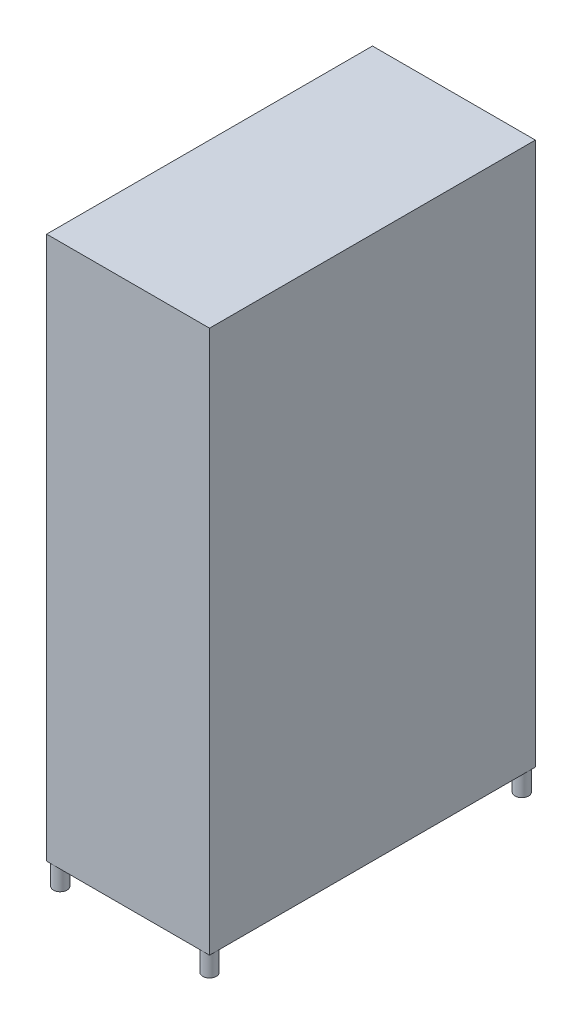
ISO-10303-21;
HEADER;
FILE_DESCRIPTION(('STEP AP214'),'2;1');
FILE_NAME('part.step','',(''),(''),'','','');
FILE_SCHEMA(('AUTOMOTIVE_DESIGN { 1 0 10303 214 1 1 1 1 }'));
ENDSEC;
DATA;
#1=APPLICATION_CONTEXT('core data for automotive mechanical design processes');
#2=APPLICATION_PROTOCOL_DEFINITION('international standard','automotive_design',2000,#1);
#3=PRODUCT_CONTEXT('',#1,'mechanical');
#4=PRODUCT('Part','Part','',(#3));
#5=PRODUCT_RELATED_PRODUCT_CATEGORY('part','',(#4));
#6=PRODUCT_DEFINITION_FORMATION('','',#4);
#7=PRODUCT_DEFINITION_CONTEXT('part definition',#1,'design');
#8=PRODUCT_DEFINITION('design','',#6,#7);
#9=PRODUCT_DEFINITION_SHAPE('','',#8);
#10=(LENGTH_UNIT() NAMED_UNIT(*) SI_UNIT(.MILLI.,.METRE.));
#11=(NAMED_UNIT(*) PLANE_ANGLE_UNIT() SI_UNIT($,.RADIAN.));
#12=(NAMED_UNIT(*) SI_UNIT($,.STERADIAN.) SOLID_ANGLE_UNIT());
#13=UNCERTAINTY_MEASURE_WITH_UNIT(LENGTH_MEASURE(1.E-05),#10,'distance_accuracy_value','');
#14=(GEOMETRIC_REPRESENTATION_CONTEXT(3) GLOBAL_UNCERTAINTY_ASSIGNED_CONTEXT((#13)) GLOBAL_UNIT_ASSIGNED_CONTEXT((#10,
#11,#12)) REPRESENTATION_CONTEXT('',''));
#15=CARTESIAN_POINT('',(0.,0.,0.));
#16=DIRECTION('',(0.,0.,1.));
#17=DIRECTION('',(1.,0.,0.));
#18=AXIS2_PLACEMENT_3D('',#15,#16,#17);
#19=CARTESIAN_POINT('',(0.,0.,0.));
#20=DIRECTION('',(0.,-1.,0.));
#21=DIRECTION('',(0.,0.,-1.));
#22=AXIS2_PLACEMENT_3D('',#19,#20,#21);
#23=PLANE('',#22);
#24=DIRECTION('',(-1.,0.,0.));
#25=VECTOR('',#24,1.);
#26=CARTESIAN_POINT('',(-300.,0.,-600.));
#27=LINE('',#26,#25);
#28=CARTESIAN_POINT('',(-275.,0.,-600.));
#29=VERTEX_POINT('',#28);
#30=CARTESIAN_POINT('',(-300.,0.,-600.));
#31=VERTEX_POINT('',#30);
#32=EDGE_CURVE('E104',#29,#31,#27,.T.);
#33=ORIENTED_EDGE('',*,*,#32,.F.);
#34=CARTESIAN_POINT('',(-275.,0.,-575.));
#35=DIRECTION('',(0.,-1.,0.));
#36=DIRECTION('',(0.,0.,1.));
#37=AXIS2_PLACEMENT_3D('',#34,#35,#36);
#38=CIRCLE('',#37,25.);
#39=CARTESIAN_POINT('',(-300.,0.,-575.));
#40=VERTEX_POINT('',#39);
#41=EDGE_CURVE('E49',#40,#29,#38,.T.);
#42=ORIENTED_EDGE('',*,*,#41,.F.);
#43=DIRECTION('',(0.,0.,1.));
#44=VECTOR('',#43,1.);
#45=CARTESIAN_POINT('',(-300.,0.,600.));
#46=LINE('',#45,#44);
#47=EDGE_CURVE('E103',#31,#40,#46,.T.);
#48=ORIENTED_EDGE('',*,*,#47,.F.);
#49=EDGE_LOOP('',(#33,#42,#48));
#50=FACE_BOUND('',#49,.T.);
#51=ADVANCED_FACE('F35',(#50),#23,.T.);
#52=CARTESIAN_POINT('',(-300.,0.,575.));
#53=VERTEX_POINT('',#52);
#54=EDGE_CURVE('E109',#40,#53,#46,.T.);
#55=ORIENTED_EDGE('',*,*,#54,.F.);
#56=CARTESIAN_POINT('',(-275.,0.,-575.));
#57=DIRECTION('',(0.,-1.,0.));
#58=DIRECTION('',(0.,0.,-1.));
#59=AXIS2_PLACEMENT_3D('',#56,#57,#58);
#60=CIRCLE('',#59,25.);
#61=EDGE_CURVE('E11',#40,#29,#60,.F.);
#62=ORIENTED_EDGE('',*,*,#61,.T.);
#63=CARTESIAN_POINT('',(275.,0.,-600.));
#64=VERTEX_POINT('',#63);
#65=EDGE_CURVE('E131',#64,#29,#27,.T.);
#66=ORIENTED_EDGE('',*,*,#65,.F.);
#67=CARTESIAN_POINT('',(275.,0.,-575.));
#68=DIRECTION('',(0.,-1.,0.));
#69=DIRECTION('',(0.,0.,-1.));
#70=AXIS2_PLACEMENT_3D('',#67,#68,#69);
#71=CIRCLE('',#70,25.);
#72=CARTESIAN_POINT('',(300.,0.,-575.));
#73=VERTEX_POINT('',#72);
#74=EDGE_CURVE('E43',#73,#64,#71,.T.);
#75=ORIENTED_EDGE('',*,*,#74,.F.);
#76=DIRECTION('',(0.,0.,-1.));
#77=VECTOR('',#76,1.);
#78=CARTESIAN_POINT('',(300.,0.,600.));
#79=LINE('',#78,#77);
#80=CARTESIAN_POINT('',(300.,0.,575.));
#81=VERTEX_POINT('',#80);
#82=EDGE_CURVE('E137',#81,#73,#79,.T.);
#83=ORIENTED_EDGE('',*,*,#82,.F.);
#84=CARTESIAN_POINT('',(275.,0.,575.));
#85=DIRECTION('',(0.,-1.,0.));
#86=DIRECTION('',(0.,0.,-1.));
#87=AXIS2_PLACEMENT_3D('',#84,#85,#86);
#88=CIRCLE('',#87,25.);
#89=CARTESIAN_POINT('',(275.,0.,600.));
#90=VERTEX_POINT('',#89);
#91=EDGE_CURVE('E154',#90,#81,#88,.T.);
#92=ORIENTED_EDGE('',*,*,#91,.F.);
#93=DIRECTION('',(1.,0.,0.));
#94=VECTOR('',#93,1.);
#95=CARTESIAN_POINT('',(-300.,0.,600.));
#96=LINE('',#95,#94);
#97=CARTESIAN_POINT('',(-275.,0.,600.));
#98=VERTEX_POINT('',#97);
#99=EDGE_CURVE('E124',#98,#90,#96,.T.);
#100=ORIENTED_EDGE('',*,*,#99,.F.);
#101=CARTESIAN_POINT('',(-275.,0.,575.));
#102=DIRECTION('',(0.,-1.,0.));
#103=DIRECTION('',(0.,0.,-1.));
#104=AXIS2_PLACEMENT_3D('',#101,#102,#103);
#105=CIRCLE('',#104,25.);
#106=EDGE_CURVE('E113',#53,#98,#105,.T.);
#107=ORIENTED_EDGE('',*,*,#106,.F.);
#108=EDGE_LOOP('',(#55,#62,#66,#75,#83,#92,#100,#107));
#109=FACE_BOUND('',#108,.T.);
#110=ADVANCED_FACE('F110',(#109),#23,.T.);
#111=CARTESIAN_POINT('',(275.,0.,-575.));
#112=DIRECTION('',(0.,1.,0.));
#113=DIRECTION('',(0.,0.,1.));
#114=AXIS2_PLACEMENT_3D('',#111,#112,#113);
#115=CIRCLE('',#114,25.);
#116=EDGE_CURVE('E182',#73,#64,#115,.T.);
#117=ORIENTED_EDGE('',*,*,#116,.T.);
#118=CARTESIAN_POINT('',(300.,0.,-600.));
#119=VERTEX_POINT('',#118);
#120=EDGE_CURVE('E128',#119,#64,#27,.T.);
#121=ORIENTED_EDGE('',*,*,#120,.F.);
#122=EDGE_CURVE('E138',#73,#119,#79,.T.);
#123=ORIENTED_EDGE('',*,*,#122,.F.);
#124=EDGE_LOOP('',(#117,#121,#123));
#125=FACE_BOUND('',#124,.T.);
#126=ADVANCED_FACE('F219',(#125),#23,.T.);
#127=CARTESIAN_POINT('',(-275.,0.,575.));
#128=DIRECTION('',(0.,1.,0.));
#129=DIRECTION('',(0.,0.,-1.));
#130=AXIS2_PLACEMENT_3D('',#127,#128,#129);
#131=CIRCLE('',#130,25.);
#132=EDGE_CURVE('E156',#53,#98,#131,.T.);
#133=ORIENTED_EDGE('',*,*,#132,.T.);
#134=CARTESIAN_POINT('',(-300.,0.,600.));
#135=VERTEX_POINT('',#134);
#136=EDGE_CURVE('E126',#135,#98,#96,.T.);
#137=ORIENTED_EDGE('',*,*,#136,.F.);
#138=EDGE_CURVE('E116',#53,#135,#46,.T.);
#139=ORIENTED_EDGE('',*,*,#138,.F.);
#140=EDGE_LOOP('',(#133,#137,#139));
#141=FACE_BOUND('',#140,.T.);
#142=ADVANCED_FACE('F197',(#141),#23,.T.);
#143=EDGE_CURVE('E147',#81,#90,#88,.T.);
#144=ORIENTED_EDGE('',*,*,#143,.F.);
#145=CARTESIAN_POINT('',(300.,0.,600.));
#146=VERTEX_POINT('',#145);
#147=EDGE_CURVE('E136',#146,#81,#79,.T.);
#148=ORIENTED_EDGE('',*,*,#147,.F.);
#149=EDGE_CURVE('E123',#90,#146,#96,.T.);
#150=ORIENTED_EDGE('',*,*,#149,.F.);
#151=EDGE_LOOP('',(#144,#148,#150));
#152=FACE_BOUND('',#151,.T.);
#153=ADVANCED_FACE('F214',(#152),#23,.T.);
#154=CARTESIAN_POINT('',(300.,2000.,600.));
#155=DIRECTION('',(-1.,0.,0.));
#156=DIRECTION('',(0.,0.,1.));
#157=AXIS2_PLACEMENT_3D('',#154,#155,#156);
#158=PLANE('',#157);
#159=ORIENTED_EDGE('',*,*,#147,.T.);
#160=ORIENTED_EDGE('',*,*,#82,.T.);
#161=ORIENTED_EDGE('',*,*,#122,.T.);
#162=DIRECTION('',(0.,-1.,0.));
#163=VECTOR('',#162,1.);
#164=CARTESIAN_POINT('',(300.,2000.,-600.));
#165=LINE('',#164,#163);
#166=CARTESIAN_POINT('',(300.,2000.,-600.));
#167=VERTEX_POINT('',#166);
#168=EDGE_CURVE('E176',#167,#119,#165,.T.);
#169=ORIENTED_EDGE('',*,*,#168,.F.);
#170=DIRECTION('',(0.,0.,-1.));
#171=VECTOR('',#170,1.);
#172=CARTESIAN_POINT('',(300.,2000.,600.));
#173=LINE('',#172,#171);
#174=CARTESIAN_POINT('',(300.,2000.,600.));
#175=VERTEX_POINT('',#174);
#176=EDGE_CURVE('E159',#175,#167,#173,.T.);
#177=ORIENTED_EDGE('',*,*,#176,.F.);
#178=DIRECTION('',(0.,-1.,0.));
#179=VECTOR('',#178,1.);
#180=CARTESIAN_POINT('',(300.,2000.,600.));
#181=LINE('',#180,#179);
#182=EDGE_CURVE('E166',#175,#146,#181,.T.);
#183=ORIENTED_EDGE('',*,*,#182,.T.);
#184=EDGE_LOOP('',(#159,#160,#161,#169,#177,#183));
#185=FACE_BOUND('',#184,.T.);
#186=ADVANCED_FACE('F37',(#185),#158,.F.);
#187=CARTESIAN_POINT('',(-300.,2000.,-600.));
#188=DIRECTION('',(0.,0.,1.));
#189=DIRECTION('',(1.,0.,0.));
#190=AXIS2_PLACEMENT_3D('',#187,#188,#189);
#191=PLANE('',#190);
#192=ORIENTED_EDGE('',*,*,#120,.T.);
#193=ORIENTED_EDGE('',*,*,#65,.T.);
#194=ORIENTED_EDGE('',*,*,#32,.T.);
#195=DIRECTION('',(0.,-1.,0.));
#196=VECTOR('',#195,1.);
#197=CARTESIAN_POINT('',(-300.,2000.,-600.));
#198=LINE('',#197,#196);
#199=CARTESIAN_POINT('',(-300.,2000.,-600.));
#200=VERTEX_POINT('',#199);
#201=EDGE_CURVE('E122',#200,#31,#198,.T.);
#202=ORIENTED_EDGE('',*,*,#201,.F.);
#203=DIRECTION('',(-1.,0.,0.));
#204=VECTOR('',#203,1.);
#205=CARTESIAN_POINT('',(-300.,2000.,-600.));
#206=LINE('',#205,#204);
#207=EDGE_CURVE('E162',#167,#200,#206,.T.);
#208=ORIENTED_EDGE('',*,*,#207,.F.);
#209=ORIENTED_EDGE('',*,*,#168,.T.);
#210=EDGE_LOOP('',(#192,#193,#194,#202,#208,#209));
#211=FACE_BOUND('',#210,.T.);
#212=ADVANCED_FACE('F229',(#211),#191,.F.);
#213=CARTESIAN_POINT('',(-300.,2000.,600.));
#214=DIRECTION('',(1.,0.,0.));
#215=DIRECTION('',(0.,0.,-1.));
#216=AXIS2_PLACEMENT_3D('',#213,#214,#215);
#217=PLANE('',#216);
#218=ORIENTED_EDGE('',*,*,#47,.T.);
#219=ORIENTED_EDGE('',*,*,#54,.T.);
#220=ORIENTED_EDGE('',*,*,#138,.T.);
#221=DIRECTION('',(0.,-1.,0.));
#222=VECTOR('',#221,1.);
#223=CARTESIAN_POINT('',(-300.,2000.,600.));
#224=LINE('',#223,#222);
#225=CARTESIAN_POINT('',(-300.,2000.,600.));
#226=VERTEX_POINT('',#225);
#227=EDGE_CURVE('E170',#226,#135,#224,.T.);
#228=ORIENTED_EDGE('',*,*,#227,.F.);
#229=DIRECTION('',(0.,0.,1.));
#230=VECTOR('',#229,1.);
#231=CARTESIAN_POINT('',(-300.,2000.,600.));
#232=LINE('',#231,#230);
#233=EDGE_CURVE('E164',#200,#226,#232,.T.);
#234=ORIENTED_EDGE('',*,*,#233,.F.);
#235=ORIENTED_EDGE('',*,*,#201,.T.);
#236=EDGE_LOOP('',(#218,#219,#220,#228,#234,#235));
#237=FACE_BOUND('',#236,.T.);
#238=ADVANCED_FACE('F119',(#237),#217,.F.);
#239=CARTESIAN_POINT('',(-300.,2000.,600.));
#240=DIRECTION('',(0.,0.,-1.));
#241=DIRECTION('',(-1.,0.,0.));
#242=AXIS2_PLACEMENT_3D('',#239,#240,#241);
#243=PLANE('',#242);
#244=ORIENTED_EDGE('',*,*,#136,.T.);
#245=ORIENTED_EDGE('',*,*,#99,.T.);
#246=ORIENTED_EDGE('',*,*,#149,.T.);
#247=ORIENTED_EDGE('',*,*,#182,.F.);
#248=DIRECTION('',(1.,0.,0.));
#249=VECTOR('',#248,1.);
#250=CARTESIAN_POINT('',(-300.,2000.,600.));
#251=LINE('',#250,#249);
#252=EDGE_CURVE('E165',#226,#175,#251,.T.);
#253=ORIENTED_EDGE('',*,*,#252,.F.);
#254=ORIENTED_EDGE('',*,*,#227,.T.);
#255=EDGE_LOOP('',(#244,#245,#246,#247,#253,#254));
#256=FACE_BOUND('',#255,.T.);
#257=ADVANCED_FACE('F237',(#256),#243,.F.);
#258=CARTESIAN_POINT('',(0.,2000.,0.));
#259=DIRECTION('',(0.,-1.,0.));
#260=DIRECTION('',(0.,0.,-1.));
#261=AXIS2_PLACEMENT_3D('',#258,#259,#260);
#262=PLANE('',#261);
#263=ORIENTED_EDGE('',*,*,#176,.T.);
#264=ORIENTED_EDGE('',*,*,#207,.T.);
#265=ORIENTED_EDGE('',*,*,#233,.T.);
#266=ORIENTED_EDGE('',*,*,#252,.T.);
#267=EDGE_LOOP('',(#263,#264,#265,#266));
#268=FACE_BOUND('',#267,.T.);
#269=ADVANCED_FACE('F238',(#268),#262,.F.);
#270=CARTESIAN_POINT('',(275.,-80.,575.));
#271=DIRECTION('',(0.,1.,0.));
#272=DIRECTION('',(0.,0.,1.));
#273=AXIS2_PLACEMENT_3D('',#270,#271,#272);
#274=CYLINDRICAL_SURFACE('',#273,25.);
#275=CARTESIAN_POINT('',(275.,-80.,575.));
#276=DIRECTION('',(0.,-1.,0.));
#277=DIRECTION('',(0.,0.,-1.));
#278=AXIS2_PLACEMENT_3D('',#275,#276,#277);
#279=CIRCLE('',#278,25.);
#280=CARTESIAN_POINT('',(275.,-80.,550.));
#281=VERTEX_POINT('',#280);
#282=EDGE_CURVE('E144',#281,#281,#279,.T.);
#283=ORIENTED_EDGE('',*,*,#282,.F.);
#284=EDGE_LOOP('',(#283));
#285=FACE_BOUND('',#284,.T.);
#286=ORIENTED_EDGE('',*,*,#143,.T.);
#287=ORIENTED_EDGE('',*,*,#91,.T.);
#288=EDGE_LOOP('',(#286,#287));
#289=FACE_BOUND('',#288,.T.);
#290=ADVANCED_FACE('F210',(#285,#289),#274,.T.);
#291=CARTESIAN_POINT('',(275.,-80.,575.));
#292=DIRECTION('',(0.,-1.,0.));
#293=DIRECTION('',(0.,0.,-1.));
#294=AXIS2_PLACEMENT_3D('',#291,#292,#293);
#295=PLANE('',#294);
#296=ORIENTED_EDGE('',*,*,#282,.T.);
#297=EDGE_LOOP('',(#296));
#298=FACE_BOUND('',#297,.T.);
#299=ADVANCED_FACE('F202',(#298),#295,.T.);
#300=CARTESIAN_POINT('',(-275.,-80.,575.));
#301=DIRECTION('',(0.,1.,0.));
#302=DIRECTION('',(0.,0.,1.));
#303=AXIS2_PLACEMENT_3D('',#300,#301,#302);
#304=CYLINDRICAL_SURFACE('',#303,25.);
#305=CARTESIAN_POINT('',(-275.,-80.,575.));
#306=DIRECTION('',(0.,1.,0.));
#307=DIRECTION('',(0.,0.,-1.));
#308=AXIS2_PLACEMENT_3D('',#305,#306,#307);
#309=CIRCLE('',#308,25.);
#310=CARTESIAN_POINT('',(-275.,-80.,550.));
#311=VERTEX_POINT('',#310);
#312=EDGE_CURVE('E152',#311,#311,#309,.T.);
#313=ORIENTED_EDGE('',*,*,#312,.T.);
#314=EDGE_LOOP('',(#313));
#315=FACE_BOUND('',#314,.T.);
#316=ORIENTED_EDGE('',*,*,#132,.F.);
#317=ORIENTED_EDGE('',*,*,#106,.T.);
#318=EDGE_LOOP('',(#316,#317));
#319=FACE_BOUND('',#318,.T.);
#320=ADVANCED_FACE('F199',(#315,#319),#304,.T.);
#321=CARTESIAN_POINT('',(-275.,-80.,575.));
#322=DIRECTION('',(0.,-1.,0.));
#323=DIRECTION('',(0.,0.,-1.));
#324=AXIS2_PLACEMENT_3D('',#321,#322,#323);
#325=PLANE('',#324);
#326=ORIENTED_EDGE('',*,*,#312,.F.);
#327=EDGE_LOOP('',(#326));
#328=FACE_BOUND('',#327,.T.);
#329=ADVANCED_FACE('F201',(#328),#325,.T.);
#330=CARTESIAN_POINT('',(275.,-80.,-575.));
#331=DIRECTION('',(0.,1.,0.));
#332=DIRECTION('',(0.,0.,1.));
#333=AXIS2_PLACEMENT_3D('',#330,#331,#332);
#334=CYLINDRICAL_SURFACE('',#333,25.);
#335=CARTESIAN_POINT('',(275.,-80.,-575.));
#336=DIRECTION('',(0.,1.,0.));
#337=DIRECTION('',(0.,0.,1.));
#338=AXIS2_PLACEMENT_3D('',#335,#336,#337);
#339=CIRCLE('',#338,25.);
#340=CARTESIAN_POINT('',(275.,-80.,-550.));
#341=VERTEX_POINT('',#340);
#342=EDGE_CURVE('E184',#341,#341,#339,.T.);
#343=ORIENTED_EDGE('',*,*,#342,.T.);
#344=EDGE_LOOP('',(#343));
#345=FACE_BOUND('',#344,.T.);
#346=ORIENTED_EDGE('',*,*,#116,.F.);
#347=ORIENTED_EDGE('',*,*,#74,.T.);
#348=EDGE_LOOP('',(#346,#347));
#349=FACE_BOUND('',#348,.T.);
#350=ADVANCED_FACE('F180',(#345,#349),#334,.T.);
#351=CARTESIAN_POINT('',(275.,-80.,-575.));
#352=DIRECTION('',(0.,-1.,0.));
#353=DIRECTION('',(0.,0.,1.));
#354=AXIS2_PLACEMENT_3D('',#351,#352,#353);
#355=PLANE('',#354);
#356=ORIENTED_EDGE('',*,*,#342,.F.);
#357=EDGE_LOOP('',(#356));
#358=FACE_BOUND('',#357,.T.);
#359=ADVANCED_FACE('F292',(#358),#355,.T.);
#360=CARTESIAN_POINT('',(-275.,-80.,-575.));
#361=DIRECTION('',(0.,1.,0.));
#362=DIRECTION('',(0.,0.,1.));
#363=AXIS2_PLACEMENT_3D('',#360,#361,#362);
#364=CYLINDRICAL_SURFACE('',#363,25.);
#365=CARTESIAN_POINT('',(-275.,-80.,-575.));
#366=DIRECTION('',(0.,-1.,0.));
#367=DIRECTION('',(0.,0.,1.));
#368=AXIS2_PLACEMENT_3D('',#365,#366,#367);
#369=CIRCLE('',#368,25.);
#370=CARTESIAN_POINT('',(-275.,-80.,-550.));
#371=VERTEX_POINT('',#370);
#372=EDGE_CURVE('E106',#371,#371,#369,.T.);
#373=ORIENTED_EDGE('',*,*,#372,.F.);
#374=EDGE_LOOP('',(#373));
#375=FACE_BOUND('',#374,.T.);
#376=ORIENTED_EDGE('',*,*,#41,.T.);
#377=ORIENTED_EDGE('',*,*,#61,.F.);
#378=EDGE_LOOP('',(#376,#377));
#379=FACE_BOUND('',#378,.T.);
#380=ADVANCED_FACE('F97',(#375,#379),#364,.T.);
#381=CARTESIAN_POINT('',(-275.,-80.,-575.));
#382=DIRECTION('',(0.,-1.,0.));
#383=DIRECTION('',(0.,0.,1.));
#384=AXIS2_PLACEMENT_3D('',#381,#382,#383);
#385=PLANE('',#384);
#386=ORIENTED_EDGE('',*,*,#372,.T.);
#387=EDGE_LOOP('',(#386));
#388=FACE_BOUND('',#387,.T.);
#389=ADVANCED_FACE('F316',(#388),#385,.T.);
#390=CLOSED_SHELL('',(#51,#110,#126,#142,#153,#186,#212,#238,#257,#269,#290,#299,#320,#329,#350,
#359,#380,#389));
#391=MANIFOLD_SOLID_BREP('B2',#390);
#392=ADVANCED_BREP_SHAPE_REPRESENTATION('',(#18,#391),#14);
#393=SHAPE_DEFINITION_REPRESENTATION(#9,#392);
ENDSEC;
END-ISO-10303-21;
